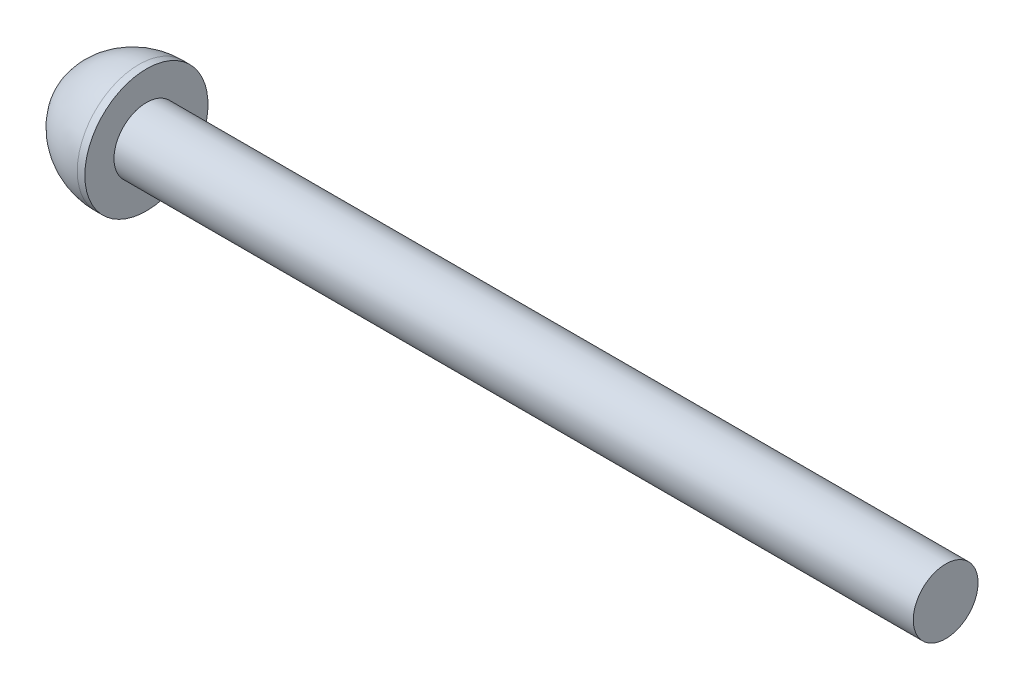
ISO-10303-21;
HEADER;
FILE_DESCRIPTION(('STEP AP214'),'2;1');
FILE_NAME('part.step','',(''),(''),'','','');
FILE_SCHEMA(('AUTOMOTIVE_DESIGN { 1 0 10303 214 1 1 1 1 }'));
ENDSEC;
DATA;
#1=APPLICATION_CONTEXT('core data for automotive mechanical design processes');
#2=APPLICATION_PROTOCOL_DEFINITION('international standard','automotive_design',2000,#1);
#3=PRODUCT_CONTEXT('',#1,'mechanical');
#4=PRODUCT('Part','Part','',(#3));
#5=PRODUCT_RELATED_PRODUCT_CATEGORY('part','',(#4));
#6=PRODUCT_DEFINITION_FORMATION('','',#4);
#7=PRODUCT_DEFINITION_CONTEXT('part definition',#1,'design');
#8=PRODUCT_DEFINITION('design','',#6,#7);
#9=PRODUCT_DEFINITION_SHAPE('','',#8);
#10=(LENGTH_UNIT() NAMED_UNIT(*) SI_UNIT(.MILLI.,.METRE.));
#11=(NAMED_UNIT(*) PLANE_ANGLE_UNIT() SI_UNIT($,.RADIAN.));
#12=(NAMED_UNIT(*) SI_UNIT($,.STERADIAN.) SOLID_ANGLE_UNIT());
#13=UNCERTAINTY_MEASURE_WITH_UNIT(LENGTH_MEASURE(1.E-05),#10,'distance_accuracy_value','');
#14=(GEOMETRIC_REPRESENTATION_CONTEXT(3) GLOBAL_UNCERTAINTY_ASSIGNED_CONTEXT((#13)) GLOBAL_UNIT_ASSIGNED_CONTEXT((#10,
#11,#12)) REPRESENTATION_CONTEXT('',''));
#15=CARTESIAN_POINT('',(0.,0.,0.));
#16=DIRECTION('',(0.,0.,1.));
#17=DIRECTION('',(1.,0.,0.));
#18=AXIS2_PLACEMENT_3D('',#15,#16,#17);
#19=CARTESIAN_POINT('',(-12.5935829423812,0.,0.));
#20=DIRECTION('',(1.,0.,0.));
#21=DIRECTION('',(0.,0.,-1.));
#22=AXIS2_PLACEMENT_3D('',#19,#20,#21);
#23=PLANE('',#22);
#24=DIRECTION('',(0.,0.866025403784438,-0.5));
#25=VECTOR('',#24,1.);
#26=CARTESIAN_POINT('',(-12.5935829423812,0.,1.7));
#27=LINE('',#26,#25);
#28=CARTESIAN_POINT('',(-12.5935829423812,0.,1.7));
#29=VERTEX_POINT('',#28);
#30=CARTESIAN_POINT('',(-12.5935829423812,1.47224318643355,0.849999999999999));
#31=VERTEX_POINT('',#30);
#32=EDGE_CURVE('E123',#29,#31,#27,.T.);
#33=ORIENTED_EDGE('',*,*,#32,.F.);
#34=DIRECTION('',(0.,0.866025403784439,0.5));
#35=VECTOR('',#34,1.);
#36=CARTESIAN_POINT('',(-12.5935829423812,-1.47224318643355,0.849999999999999));
#37=LINE('',#36,#35);
#38=CARTESIAN_POINT('',(-12.5935829423812,-1.47224318643355,0.849999999999999));
#39=VERTEX_POINT('',#38);
#40=EDGE_CURVE('E49',#39,#29,#37,.T.);
#41=ORIENTED_EDGE('',*,*,#40,.F.);
#42=DIRECTION('',(0.,0.,1.));
#43=VECTOR('',#42,1.);
#44=CARTESIAN_POINT('',(-12.5935829423812,-1.47224318643355,-0.850000000000001));
#45=LINE('',#44,#43);
#46=CARTESIAN_POINT('',(-12.5935829423812,-1.47224318643355,-0.850000000000001));
#47=VERTEX_POINT('',#46);
#48=EDGE_CURVE('E132',#47,#39,#45,.T.);
#49=ORIENTED_EDGE('',*,*,#48,.F.);
#50=DIRECTION('',(0.,-0.866025403784439,0.5));
#51=VECTOR('',#50,1.);
#52=CARTESIAN_POINT('',(-12.5935829423812,0.,-1.7));
#53=LINE('',#52,#51);
#54=CARTESIAN_POINT('',(-12.5935829423812,0.,-1.7));
#55=VERTEX_POINT('',#54);
#56=EDGE_CURVE('E130',#55,#47,#53,.T.);
#57=ORIENTED_EDGE('',*,*,#56,.F.);
#58=DIRECTION('',(0.,-0.866025403784439,-0.499999999999999));
#59=VECTOR('',#58,1.);
#60=CARTESIAN_POINT('',(-12.5935829423812,1.47224318643355,-0.850000000000001));
#61=LINE('',#60,#59);
#62=CARTESIAN_POINT('',(-12.5935829423812,1.47224318643355,-0.850000000000001));
#63=VERTEX_POINT('',#62);
#64=EDGE_CURVE('E97',#63,#55,#61,.T.);
#65=ORIENTED_EDGE('',*,*,#64,.F.);
#66=DIRECTION('',(0.,0.,-1.));
#67=VECTOR('',#66,1.);
#68=CARTESIAN_POINT('',(-12.5935829423812,1.47224318643355,0.849999999999999));
#69=LINE('',#68,#67);
#70=EDGE_CURVE('E126',#31,#63,#69,.T.);
#71=ORIENTED_EDGE('',*,*,#70,.F.);
#72=EDGE_LOOP('',(#33,#41,#49,#57,#65,#71));
#73=FACE_BOUND('',#72,.T.);
#74=CARTESIAN_POINT('',(-12.5935829423812,0.,0.));
#75=DIRECTION('',(-1.,0.,0.));
#76=DIRECTION('',(0.,0.,1.));
#77=AXIS2_PLACEMENT_3D('',#74,#75,#76);
#78=CIRCLE('',#77,2.431);
#79=CARTESIAN_POINT('',(-12.5935829423812,0.,2.431));
#80=VERTEX_POINT('',#79);
#81=EDGE_CURVE('E11',#80,#80,#78,.T.);
#82=ORIENTED_EDGE('',*,*,#81,.T.);
#83=EDGE_LOOP('',(#82));
#84=FACE_BOUND('',#83,.T.);
#85=ADVANCED_FACE('F35',(#73,#84),#23,.F.);
#86=CARTESIAN_POINT('',(-7.8082716672393,0.,0.));
#87=DIRECTION('',(-1.,0.,0.));
#88=DIRECTION('',(0.,0.,1.));
#89=AXIS2_PLACEMENT_3D('',#86,#87,#88);
#90=DEGENERATE_TOROIDAL_SURFACE('',#89,1.105,5.95,.F.);
#91=ORIENTED_EDGE('',*,*,#81,.F.);
#92=EDGE_LOOP('',(#91));
#93=FACE_BOUND('',#92,.T.);
#94=CARTESIAN_POINT('',(-7.8082716672393,0.,0.));
#95=DIRECTION('',(-1.,0.,0.));
#96=DIRECTION('',(0.,0.,1.));
#97=AXIS2_PLACEMENT_3D('',#94,#95,#96);
#98=CIRCLE('',#97,4.845);
#99=CARTESIAN_POINT('',(-7.8082716672393,0.,4.845));
#100=VERTEX_POINT('',#99);
#101=EDGE_CURVE('E42',#100,#100,#98,.T.);
#102=ORIENTED_EDGE('',*,*,#101,.T.);
#103=EDGE_LOOP('',(#102));
#104=FACE_BOUND('',#103,.T.);
#105=ADVANCED_FACE('F152',(#93,#104),#90,.F.);
#106=CARTESIAN_POINT('',(-12.5935829423812,0.,0.));
#107=DIRECTION('',(-1.,0.,0.));
#108=DIRECTION('',(0.,0.,1.));
#109=AXIS2_PLACEMENT_3D('',#106,#107,#108);
#110=CYLINDRICAL_SURFACE('',#109,4.845);
#111=ORIENTED_EDGE('',*,*,#101,.F.);
#112=EDGE_LOOP('',(#111));
#113=FACE_BOUND('',#112,.T.);
#114=CARTESIAN_POINT('',(-7.2132716672393,0.,0.));
#115=DIRECTION('',(-1.,0.,0.));
#116=DIRECTION('',(0.,0.,1.));
#117=AXIS2_PLACEMENT_3D('',#114,#115,#116);
#118=CIRCLE('',#117,4.845);
#119=CARTESIAN_POINT('',(-7.2132716672393,0.,4.845));
#120=VERTEX_POINT('',#119);
#121=EDGE_CURVE('E147',#120,#120,#118,.T.);
#122=ORIENTED_EDGE('',*,*,#121,.T.);
#123=EDGE_LOOP('',(#122));
#124=FACE_BOUND('',#123,.T.);
#125=ADVANCED_FACE('F154',(#113,#124),#110,.T.);
#126=CARTESIAN_POINT('',(-7.2132716672393,4.845,0.));
#127=DIRECTION('',(-1.,0.,0.));
#128=DIRECTION('',(0.,0.,1.));
#129=AXIS2_PLACEMENT_3D('',#126,#127,#128);
#130=PLANE('',#129);
#131=ORIENTED_EDGE('',*,*,#121,.F.);
#132=EDGE_LOOP('',(#131));
#133=FACE_BOUND('',#132,.T.);
#134=CARTESIAN_POINT('',(-7.2132716672393,0.,0.));
#135=DIRECTION('',(-1.,0.,0.));
#136=DIRECTION('',(0.,0.,1.));
#137=AXIS2_PLACEMENT_3D('',#134,#135,#136);
#138=CIRCLE('',#137,2.55);
#139=CARTESIAN_POINT('',(-7.2132716672393,0.,2.55));
#140=VERTEX_POINT('',#139);
#141=EDGE_CURVE('E144',#140,#140,#138,.T.);
#142=ORIENTED_EDGE('',*,*,#141,.T.);
#143=EDGE_LOOP('',(#142));
#144=FACE_BOUND('',#143,.T.);
#145=ADVANCED_FACE('F157',(#133,#144),#130,.F.);
#146=CARTESIAN_POINT('',(-12.5935829423812,0.,0.));
#147=DIRECTION('',(-1.,0.,0.));
#148=DIRECTION('',(0.,0.,1.));
#149=AXIS2_PLACEMENT_3D('',#146,#147,#148);
#150=CYLINDRICAL_SURFACE('',#149,2.55);
#151=ORIENTED_EDGE('',*,*,#141,.F.);
#152=EDGE_LOOP('',(#151));
#153=FACE_BOUND('',#152,.T.);
#154=CARTESIAN_POINT('',(55.6867283327607,0.,0.));
#155=DIRECTION('',(-1.,0.,0.));
#156=DIRECTION('',(0.,0.,1.));
#157=AXIS2_PLACEMENT_3D('',#154,#155,#156);
#158=CIRCLE('',#157,2.55);
#159=CARTESIAN_POINT('',(55.6867283327607,0.,2.55));
#160=VERTEX_POINT('',#159);
#161=EDGE_CURVE('E136',#160,#160,#158,.T.);
#162=ORIENTED_EDGE('',*,*,#161,.T.);
#163=EDGE_LOOP('',(#162));
#164=FACE_BOUND('',#163,.T.);
#165=ADVANCED_FACE('F163',(#153,#164),#150,.T.);
#166=CARTESIAN_POINT('',(55.6867283327607,2.55,0.));
#167=DIRECTION('',(-1.,0.,0.));
#168=DIRECTION('',(0.,0.,1.));
#169=AXIS2_PLACEMENT_3D('',#166,#167,#168);
#170=PLANE('',#169);
#171=ORIENTED_EDGE('',*,*,#161,.F.);
#172=EDGE_LOOP('',(#171));
#173=FACE_BOUND('',#172,.T.);
#174=ADVANCED_FACE('F169',(#173),#170,.F.);
#175=CARTESIAN_POINT('',(-10.8935829423812,-1.47224318643355,0.849999999999999));
#176=DIRECTION('',(0.,-0.5,0.866025403784439));
#177=DIRECTION('',(0.,-0.866025403784439,-0.5));
#178=AXIS2_PLACEMENT_3D('',#175,#176,#177);
#179=PLANE('',#178);
#180=ORIENTED_EDGE('',*,*,#40,.T.);
#181=DIRECTION('',(-1.,0.,0.));
#182=VECTOR('',#181,1.);
#183=CARTESIAN_POINT('',(-10.8935829423812,0.,1.7));
#184=LINE('',#183,#182);
#185=CARTESIAN_POINT('',(-10.8935829423812,0.,1.7));
#186=VERTEX_POINT('',#185);
#187=EDGE_CURVE('E79',#186,#29,#184,.T.);
#188=ORIENTED_EDGE('',*,*,#187,.F.);
#189=DIRECTION('',(0.,0.866025403784439,0.5));
#190=VECTOR('',#189,1.);
#191=CARTESIAN_POINT('',(-10.8935829423812,-1.47224318643355,0.849999999999999));
#192=LINE('',#191,#190);
#193=CARTESIAN_POINT('',(-10.8935829423812,-1.47224318643355,0.849999999999999));
#194=VERTEX_POINT('',#193);
#195=EDGE_CURVE('E134',#194,#186,#192,.T.);
#196=ORIENTED_EDGE('',*,*,#195,.F.);
#197=DIRECTION('',(-1.,0.,0.));
#198=VECTOR('',#197,1.);
#199=CARTESIAN_POINT('',(-10.8935829423812,-1.47224318643355,0.849999999999999));
#200=LINE('',#199,#198);
#201=EDGE_CURVE('E57',#194,#39,#200,.T.);
#202=ORIENTED_EDGE('',*,*,#201,.T.);
#203=EDGE_LOOP('',(#180,#188,#196,#202));
#204=FACE_BOUND('',#203,.T.);
#205=ADVANCED_FACE('F174',(#204),#179,.F.);
#206=CARTESIAN_POINT('',(-10.8935829423812,-1.47224318643355,-0.850000000000001));
#207=DIRECTION('',(0.,-1.,0.));
#208=DIRECTION('',(0.,0.,-1.));
#209=AXIS2_PLACEMENT_3D('',#206,#207,#208);
#210=PLANE('',#209);
#211=ORIENTED_EDGE('',*,*,#48,.T.);
#212=ORIENTED_EDGE('',*,*,#201,.F.);
#213=DIRECTION('',(0.,0.,1.));
#214=VECTOR('',#213,1.);
#215=CARTESIAN_POINT('',(-10.8935829423812,-1.47224318643355,-0.850000000000001));
#216=LINE('',#215,#214);
#217=CARTESIAN_POINT('',(-10.8935829423812,-1.47224318643355,-0.850000000000001));
#218=VERTEX_POINT('',#217);
#219=EDGE_CURVE('E109',#218,#194,#216,.T.);
#220=ORIENTED_EDGE('',*,*,#219,.F.);
#221=DIRECTION('',(-1.,0.,0.));
#222=VECTOR('',#221,1.);
#223=CARTESIAN_POINT('',(-10.8935829423812,-1.47224318643355,-0.850000000000001));
#224=LINE('',#223,#222);
#225=EDGE_CURVE('E101',#218,#47,#224,.T.);
#226=ORIENTED_EDGE('',*,*,#225,.T.);
#227=EDGE_LOOP('',(#211,#212,#220,#226));
#228=FACE_BOUND('',#227,.T.);
#229=ADVANCED_FACE('F179',(#228),#210,.F.);
#230=CARTESIAN_POINT('',(-10.8935829423812,0.,-1.7));
#231=DIRECTION('',(0.,-0.5,-0.866025403784439));
#232=DIRECTION('',(0.,0.866025403784439,-0.5));
#233=AXIS2_PLACEMENT_3D('',#230,#231,#232);
#234=PLANE('',#233);
#235=ORIENTED_EDGE('',*,*,#56,.T.);
#236=ORIENTED_EDGE('',*,*,#225,.F.);
#237=DIRECTION('',(0.,-0.866025403784439,0.5));
#238=VECTOR('',#237,1.);
#239=CARTESIAN_POINT('',(-10.8935829423812,0.,-1.7));
#240=LINE('',#239,#238);
#241=CARTESIAN_POINT('',(-10.8935829423812,0.,-1.7));
#242=VERTEX_POINT('',#241);
#243=EDGE_CURVE('E105',#242,#218,#240,.T.);
#244=ORIENTED_EDGE('',*,*,#243,.F.);
#245=DIRECTION('',(-1.,0.,0.));
#246=VECTOR('',#245,1.);
#247=CARTESIAN_POINT('',(-10.8935829423812,0.,-1.7));
#248=LINE('',#247,#246);
#249=EDGE_CURVE('E90',#242,#55,#248,.T.);
#250=ORIENTED_EDGE('',*,*,#249,.T.);
#251=EDGE_LOOP('',(#235,#236,#244,#250));
#252=FACE_BOUND('',#251,.T.);
#253=ADVANCED_FACE('F106',(#252),#234,.F.);
#254=CARTESIAN_POINT('',(-10.8935829423812,1.47224318643355,-0.850000000000001));
#255=DIRECTION('',(0.,0.5,-0.866025403784439));
#256=DIRECTION('',(0.,0.866025403784439,0.499999999999999));
#257=AXIS2_PLACEMENT_3D('',#254,#255,#256);
#258=PLANE('',#257);
#259=ORIENTED_EDGE('',*,*,#64,.T.);
#260=ORIENTED_EDGE('',*,*,#249,.F.);
#261=DIRECTION('',(0.,-0.866025403784439,-0.499999999999999));
#262=VECTOR('',#261,1.);
#263=CARTESIAN_POINT('',(-10.8935829423812,1.47224318643355,-0.850000000000001));
#264=LINE('',#263,#262);
#265=CARTESIAN_POINT('',(-10.8935829423812,1.47224318643355,-0.850000000000001));
#266=VERTEX_POINT('',#265);
#267=EDGE_CURVE('E94',#266,#242,#264,.T.);
#268=ORIENTED_EDGE('',*,*,#267,.F.);
#269=DIRECTION('',(-1.,0.,0.));
#270=VECTOR('',#269,1.);
#271=CARTESIAN_POINT('',(-10.8935829423812,1.47224318643355,-0.850000000000001));
#272=LINE('',#271,#270);
#273=EDGE_CURVE('E102',#266,#63,#272,.T.);
#274=ORIENTED_EDGE('',*,*,#273,.T.);
#275=EDGE_LOOP('',(#259,#260,#268,#274));
#276=FACE_BOUND('',#275,.T.);
#277=ADVANCED_FACE('F92',(#276),#258,.F.);
#278=CARTESIAN_POINT('',(-10.8935829423812,1.47224318643355,0.849999999999999));
#279=DIRECTION('',(0.,1.,0.));
#280=DIRECTION('',(0.,0.,1.));
#281=AXIS2_PLACEMENT_3D('',#278,#279,#280);
#282=PLANE('',#281);
#283=ORIENTED_EDGE('',*,*,#70,.T.);
#284=ORIENTED_EDGE('',*,*,#273,.F.);
#285=DIRECTION('',(0.,0.,-1.));
#286=VECTOR('',#285,1.);
#287=CARTESIAN_POINT('',(-10.8935829423812,1.47224318643355,0.849999999999999));
#288=LINE('',#287,#286);
#289=CARTESIAN_POINT('',(-10.8935829423812,1.47224318643355,0.849999999999999));
#290=VERTEX_POINT('',#289);
#291=EDGE_CURVE('E115',#290,#266,#288,.T.);
#292=ORIENTED_EDGE('',*,*,#291,.F.);
#293=DIRECTION('',(-1.,0.,0.));
#294=VECTOR('',#293,1.);
#295=CARTESIAN_POINT('',(-10.8935829423812,1.47224318643355,0.849999999999999));
#296=LINE('',#295,#294);
#297=EDGE_CURVE('E139',#290,#31,#296,.T.);
#298=ORIENTED_EDGE('',*,*,#297,.T.);
#299=EDGE_LOOP('',(#283,#284,#292,#298));
#300=FACE_BOUND('',#299,.T.);
#301=ADVANCED_FACE('F205',(#300),#282,.F.);
#302=CARTESIAN_POINT('',(-10.8935829423812,0.,1.7));
#303=DIRECTION('',(0.,0.5,0.866025403784438));
#304=DIRECTION('',(0.,-0.866025403784438,0.5));
#305=AXIS2_PLACEMENT_3D('',#302,#303,#304);
#306=PLANE('',#305);
#307=ORIENTED_EDGE('',*,*,#32,.T.);
#308=ORIENTED_EDGE('',*,*,#297,.F.);
#309=DIRECTION('',(0.,0.866025403784438,-0.5));
#310=VECTOR('',#309,1.);
#311=CARTESIAN_POINT('',(-10.8935829423812,0.,1.7));
#312=LINE('',#311,#310);
#313=EDGE_CURVE('E117',#186,#290,#312,.T.);
#314=ORIENTED_EDGE('',*,*,#313,.F.);
#315=ORIENTED_EDGE('',*,*,#187,.T.);
#316=EDGE_LOOP('',(#307,#308,#314,#315));
#317=FACE_BOUND('',#316,.T.);
#318=ADVANCED_FACE('F193',(#317),#306,.F.);
#319=CARTESIAN_POINT('',(-10.8935829423812,0.,0.));
#320=DIRECTION('',(-1.,0.,0.));
#321=DIRECTION('',(0.,0.,1.));
#322=AXIS2_PLACEMENT_3D('',#319,#320,#321);
#323=PLANE('',#322);
#324=ORIENTED_EDGE('',*,*,#195,.T.);
#325=ORIENTED_EDGE('',*,*,#313,.T.);
#326=ORIENTED_EDGE('',*,*,#291,.T.);
#327=ORIENTED_EDGE('',*,*,#267,.T.);
#328=ORIENTED_EDGE('',*,*,#243,.T.);
#329=ORIENTED_EDGE('',*,*,#219,.T.);
#330=EDGE_LOOP('',(#324,#325,#326,#327,#328,#329));
#331=FACE_BOUND('',#330,.T.);
#332=ADVANCED_FACE('F112',(#331),#323,.T.);
#333=CLOSED_SHELL('',(#85,#105,#125,#145,#165,#174,#205,#229,#253,#277,#301,#318,#332));
#334=MANIFOLD_SOLID_BREP('B2',#333);
#335=ADVANCED_BREP_SHAPE_REPRESENTATION('',(#18,#334),#14);
#336=SHAPE_DEFINITION_REPRESENTATION(#9,#335);
ENDSEC;
END-ISO-10303-21;
